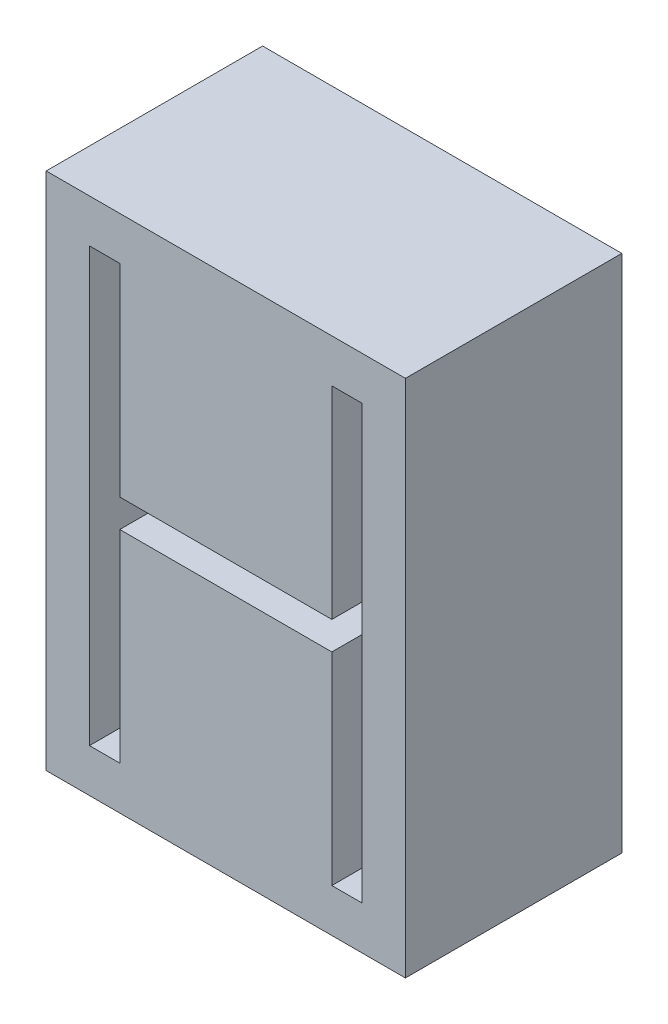
ISO-10303-21;
HEADER;
FILE_DESCRIPTION(('STEP AP214'),'2;1');
FILE_NAME('part.step','',(''),(''),'','','');
FILE_SCHEMA(('AUTOMOTIVE_DESIGN { 1 0 10303 214 1 1 1 1 }'));
ENDSEC;
DATA;
#1=APPLICATION_CONTEXT('core data for automotive mechanical design processes');
#2=APPLICATION_PROTOCOL_DEFINITION('international standard','automotive_design',2000,#1);
#3=PRODUCT_CONTEXT('',#1,'mechanical');
#4=PRODUCT('Part','Part','',(#3));
#5=PRODUCT_RELATED_PRODUCT_CATEGORY('part','',(#4));
#6=PRODUCT_DEFINITION_FORMATION('','',#4);
#7=PRODUCT_DEFINITION_CONTEXT('part definition',#1,'design');
#8=PRODUCT_DEFINITION('design','',#6,#7);
#9=PRODUCT_DEFINITION_SHAPE('','',#8);
#10=(LENGTH_UNIT() NAMED_UNIT(*) SI_UNIT(.MILLI.,.METRE.));
#11=(NAMED_UNIT(*) PLANE_ANGLE_UNIT() SI_UNIT($,.RADIAN.));
#12=(NAMED_UNIT(*) SI_UNIT($,.STERADIAN.) SOLID_ANGLE_UNIT());
#13=UNCERTAINTY_MEASURE_WITH_UNIT(LENGTH_MEASURE(1.E-05),#10,'distance_accuracy_value','');
#14=(GEOMETRIC_REPRESENTATION_CONTEXT(3) GLOBAL_UNCERTAINTY_ASSIGNED_CONTEXT((#13)) GLOBAL_UNIT_ASSIGNED_CONTEXT((#10,
#11,#12)) REPRESENTATION_CONTEXT('',''));
#15=CARTESIAN_POINT('',(0.,0.,0.));
#16=DIRECTION('',(0.,0.,1.));
#17=DIRECTION('',(1.,0.,0.));
#18=AXIS2_PLACEMENT_3D('',#15,#16,#17);
#19=CARTESIAN_POINT('',(0.,0.,10.));
#20=DIRECTION('',(0.,0.,-1.));
#21=DIRECTION('',(-1.,0.,0.));
#22=AXIS2_PLACEMENT_3D('',#19,#20,#21);
#23=PLANE('',#22);
#24=DIRECTION('',(0.,1.,0.));
#25=VECTOR('',#24,1.);
#26=CARTESIAN_POINT('',(8.3,-12.,10.));
#27=LINE('',#26,#25);
#28=CARTESIAN_POINT('',(8.3,-12.,10.));
#29=VERTEX_POINT('',#28);
#30=CARTESIAN_POINT('',(8.3,12.,10.));
#31=VERTEX_POINT('',#30);
#32=EDGE_CURVE('E255',#29,#31,#27,.T.);
#33=ORIENTED_EDGE('',*,*,#32,.T.);
#34=DIRECTION('',(-1.,0.,0.));
#35=VECTOR('',#34,1.);
#36=CARTESIAN_POINT('',(-8.3,12.,10.));
#37=LINE('',#36,#35);
#38=CARTESIAN_POINT('',(-8.3,12.,10.));
#39=VERTEX_POINT('',#38);
#40=EDGE_CURVE('E288',#31,#39,#37,.T.);
#41=ORIENTED_EDGE('',*,*,#40,.T.);
#42=DIRECTION('',(0.,-1.,0.));
#43=VECTOR('',#42,1.);
#44=CARTESIAN_POINT('',(-8.3,-12.,10.));
#45=LINE('',#44,#43);
#46=CARTESIAN_POINT('',(-8.3,-12.,10.));
#47=VERTEX_POINT('',#46);
#48=EDGE_CURVE('E241',#39,#47,#45,.T.);
#49=ORIENTED_EDGE('',*,*,#48,.T.);
#50=DIRECTION('',(1.,0.,0.));
#51=VECTOR('',#50,1.);
#52=CARTESIAN_POINT('',(-8.3,-12.,10.));
#53=LINE('',#52,#51);
#54=EDGE_CURVE('E236',#47,#29,#53,.T.);
#55=ORIENTED_EDGE('',*,*,#54,.T.);
#56=EDGE_LOOP('',(#33,#41,#49,#55));
#57=FACE_BOUND('',#56,.T.);
#58=DIRECTION('',(1.,0.,0.));
#59=VECTOR('',#58,1.);
#60=CARTESIAN_POINT('',(4.9,-10.,10.));
#61=LINE('',#60,#59);
#62=CARTESIAN_POINT('',(4.9,-10.,10.));
#63=VERTEX_POINT('',#62);
#64=CARTESIAN_POINT('',(6.3,-10.,10.));
#65=VERTEX_POINT('',#64);
#66=EDGE_CURVE('E154',#63,#65,#61,.T.);
#67=ORIENTED_EDGE('',*,*,#66,.F.);
#68=DIRECTION('',(0.,-1.,0.));
#69=VECTOR('',#68,1.);
#70=CARTESIAN_POINT('',(4.9,-10.,10.));
#71=LINE('',#70,#69);
#72=CARTESIAN_POINT('',(4.9,-0.65,10.));
#73=VERTEX_POINT('',#72);
#74=EDGE_CURVE('E226',#73,#63,#71,.T.);
#75=ORIENTED_EDGE('',*,*,#74,.F.);
#76=DIRECTION('',(1.,0.,0.));
#77=VECTOR('',#76,1.);
#78=CARTESIAN_POINT('',(-4.9,-0.65,10.));
#79=LINE('',#78,#77);
#80=CARTESIAN_POINT('',(-4.9,-0.65,10.));
#81=VERTEX_POINT('',#80);
#82=EDGE_CURVE('E222',#81,#73,#79,.T.);
#83=ORIENTED_EDGE('',*,*,#82,.F.);
#84=DIRECTION('',(0.,1.,0.));
#85=VECTOR('',#84,1.);
#86=CARTESIAN_POINT('',(-4.9,-10.,10.));
#87=LINE('',#86,#85);
#88=CARTESIAN_POINT('',(-4.9,-10.,10.));
#89=VERTEX_POINT('',#88);
#90=EDGE_CURVE('E218',#89,#81,#87,.T.);
#91=ORIENTED_EDGE('',*,*,#90,.F.);
#92=DIRECTION('',(1.,0.,0.));
#93=VECTOR('',#92,1.);
#94=CARTESIAN_POINT('',(-6.3,-10.,10.));
#95=LINE('',#94,#93);
#96=CARTESIAN_POINT('',(-6.3,-10.,10.));
#97=VERTEX_POINT('',#96);
#98=EDGE_CURVE('E215',#97,#89,#95,.T.);
#99=ORIENTED_EDGE('',*,*,#98,.F.);
#100=DIRECTION('',(0.,-1.,0.));
#101=VECTOR('',#100,1.);
#102=CARTESIAN_POINT('',(-6.3,10.,10.));
#103=LINE('',#102,#101);
#104=CARTESIAN_POINT('',(-6.3,10.,10.));
#105=VERTEX_POINT('',#104);
#106=EDGE_CURVE('E207',#105,#97,#103,.T.);
#107=ORIENTED_EDGE('',*,*,#106,.F.);
#108=DIRECTION('',(-1.,0.,0.));
#109=VECTOR('',#108,1.);
#110=CARTESIAN_POINT('',(-6.3,10.,10.));
#111=LINE('',#110,#109);
#112=CARTESIAN_POINT('',(-4.9,10.,10.));
#113=VERTEX_POINT('',#112);
#114=EDGE_CURVE('E203',#113,#105,#111,.T.);
#115=ORIENTED_EDGE('',*,*,#114,.F.);
#116=DIRECTION('',(0.,1.,0.));
#117=VECTOR('',#116,1.);
#118=CARTESIAN_POINT('',(-4.9,10.,10.));
#119=LINE('',#118,#117);
#120=CARTESIAN_POINT('',(-4.9,0.65,10.));
#121=VERTEX_POINT('',#120);
#122=EDGE_CURVE('E199',#121,#113,#119,.T.);
#123=ORIENTED_EDGE('',*,*,#122,.F.);
#124=DIRECTION('',(-1.,0.,0.));
#125=VECTOR('',#124,1.);
#126=CARTESIAN_POINT('',(-4.9,0.65,10.));
#127=LINE('',#126,#125);
#128=CARTESIAN_POINT('',(4.9,0.65,10.));
#129=VERTEX_POINT('',#128);
#130=EDGE_CURVE('E196',#129,#121,#127,.T.);
#131=ORIENTED_EDGE('',*,*,#130,.F.);
#132=DIRECTION('',(0.,-1.,0.));
#133=VECTOR('',#132,1.);
#134=CARTESIAN_POINT('',(4.9,10.,10.));
#135=LINE('',#134,#133);
#136=CARTESIAN_POINT('',(4.9,10.,10.));
#137=VERTEX_POINT('',#136);
#138=EDGE_CURVE('E183',#137,#129,#135,.T.);
#139=ORIENTED_EDGE('',*,*,#138,.F.);
#140=DIRECTION('',(-1.,0.,0.));
#141=VECTOR('',#140,1.);
#142=CARTESIAN_POINT('',(4.9,10.,10.));
#143=LINE('',#142,#141);
#144=CARTESIAN_POINT('',(6.3,10.,10.));
#145=VERTEX_POINT('',#144);
#146=EDGE_CURVE('E177',#145,#137,#143,.T.);
#147=ORIENTED_EDGE('',*,*,#146,.F.);
#148=DIRECTION('',(0.,1.,0.));
#149=VECTOR('',#148,1.);
#150=CARTESIAN_POINT('',(6.3,10.,10.));
#151=LINE('',#150,#149);
#152=EDGE_CURVE('E163',#65,#145,#151,.T.);
#153=ORIENTED_EDGE('',*,*,#152,.F.);
#154=EDGE_LOOP('',(#67,#75,#83,#91,#99,#107,#115,#123,#131,#139,#147,#153));
#155=FACE_BOUND('',#154,.T.);
#156=ADVANCED_FACE('F40',(#57,#155),#23,.F.);
#157=CARTESIAN_POINT('',(0.,0.,0.));
#158=DIRECTION('',(0.,0.,-1.));
#159=DIRECTION('',(-1.,0.,0.));
#160=AXIS2_PLACEMENT_3D('',#157,#158,#159);
#161=PLANE('',#160);
#162=DIRECTION('',(0.,1.,0.));
#163=VECTOR('',#162,1.);
#164=CARTESIAN_POINT('',(8.3,-12.,0.));
#165=LINE('',#164,#163);
#166=CARTESIAN_POINT('',(8.3,-12.,0.));
#167=VERTEX_POINT('',#166);
#168=CARTESIAN_POINT('',(8.3,12.,0.));
#169=VERTEX_POINT('',#168);
#170=EDGE_CURVE('E172',#167,#169,#165,.T.);
#171=ORIENTED_EDGE('',*,*,#170,.F.);
#172=DIRECTION('',(1.,0.,0.));
#173=VECTOR('',#172,1.);
#174=CARTESIAN_POINT('',(-8.3,-12.,0.));
#175=LINE('',#174,#173);
#176=CARTESIAN_POINT('',(-8.3,-12.,0.));
#177=VERTEX_POINT('',#176);
#178=EDGE_CURVE('E253',#177,#167,#175,.T.);
#179=ORIENTED_EDGE('',*,*,#178,.F.);
#180=DIRECTION('',(0.,-1.,0.));
#181=VECTOR('',#180,1.);
#182=CARTESIAN_POINT('',(-8.3,-12.,0.));
#183=LINE('',#182,#181);
#184=CARTESIAN_POINT('',(-8.3,12.,0.));
#185=VERTEX_POINT('',#184);
#186=EDGE_CURVE('E250',#185,#177,#183,.T.);
#187=ORIENTED_EDGE('',*,*,#186,.F.);
#188=DIRECTION('',(-1.,0.,0.));
#189=VECTOR('',#188,1.);
#190=CARTESIAN_POINT('',(-8.3,12.,0.));
#191=LINE('',#190,#189);
#192=EDGE_CURVE('E247',#169,#185,#191,.T.);
#193=ORIENTED_EDGE('',*,*,#192,.F.);
#194=EDGE_LOOP('',(#171,#179,#187,#193));
#195=FACE_BOUND('',#194,.T.);
#196=DIRECTION('',(0.,-1.,0.));
#197=VECTOR('',#196,1.);
#198=CARTESIAN_POINT('',(4.9,-10.,0.));
#199=LINE('',#198,#197);
#200=CARTESIAN_POINT('',(4.9,-0.65,0.));
#201=VERTEX_POINT('',#200);
#202=CARTESIAN_POINT('',(4.9,-10.,0.));
#203=VERTEX_POINT('',#202);
#204=EDGE_CURVE('E164',#201,#203,#199,.T.);
#205=ORIENTED_EDGE('',*,*,#204,.T.);
#206=DIRECTION('',(1.,0.,0.));
#207=VECTOR('',#206,1.);
#208=CARTESIAN_POINT('',(4.9,-10.,0.));
#209=LINE('',#208,#207);
#210=CARTESIAN_POINT('',(6.3,-10.,0.));
#211=VERTEX_POINT('',#210);
#212=EDGE_CURVE('E64',#203,#211,#209,.T.);
#213=ORIENTED_EDGE('',*,*,#212,.T.);
#214=DIRECTION('',(0.,1.,0.));
#215=VECTOR('',#214,1.);
#216=CARTESIAN_POINT('',(6.3,10.,0.));
#217=LINE('',#216,#215);
#218=CARTESIAN_POINT('',(6.3,10.,0.));
#219=VERTEX_POINT('',#218);
#220=EDGE_CURVE('E170',#211,#219,#217,.T.);
#221=ORIENTED_EDGE('',*,*,#220,.T.);
#222=DIRECTION('',(-1.,0.,0.));
#223=VECTOR('',#222,1.);
#224=CARTESIAN_POINT('',(4.9,10.,0.));
#225=LINE('',#224,#223);
#226=CARTESIAN_POINT('',(4.9,10.,0.));
#227=VERTEX_POINT('',#226);
#228=EDGE_CURVE('E359',#219,#227,#225,.T.);
#229=ORIENTED_EDGE('',*,*,#228,.T.);
#230=DIRECTION('',(0.,-1.,0.));
#231=VECTOR('',#230,1.);
#232=CARTESIAN_POINT('',(4.9,10.,0.));
#233=LINE('',#232,#231);
#234=CARTESIAN_POINT('',(4.9,0.65,0.));
#235=VERTEX_POINT('',#234);
#236=EDGE_CURVE('E355',#227,#235,#233,.T.);
#237=ORIENTED_EDGE('',*,*,#236,.T.);
#238=DIRECTION('',(-1.,0.,0.));
#239=VECTOR('',#238,1.);
#240=CARTESIAN_POINT('',(-4.9,0.65,0.));
#241=LINE('',#240,#239);
#242=CARTESIAN_POINT('',(-4.9,0.65,0.));
#243=VERTEX_POINT('',#242);
#244=EDGE_CURVE('E352',#235,#243,#241,.T.);
#245=ORIENTED_EDGE('',*,*,#244,.T.);
#246=DIRECTION('',(0.,1.,0.));
#247=VECTOR('',#246,1.);
#248=CARTESIAN_POINT('',(-4.9,10.,0.));
#249=LINE('',#248,#247);
#250=CARTESIAN_POINT('',(-4.9,10.,0.));
#251=VERTEX_POINT('',#250);
#252=EDGE_CURVE('E348',#243,#251,#249,.T.);
#253=ORIENTED_EDGE('',*,*,#252,.T.);
#254=DIRECTION('',(-1.,0.,0.));
#255=VECTOR('',#254,1.);
#256=CARTESIAN_POINT('',(-6.3,10.,0.));
#257=LINE('',#256,#255);
#258=CARTESIAN_POINT('',(-6.3,10.,0.));
#259=VERTEX_POINT('',#258);
#260=EDGE_CURVE('E344',#251,#259,#257,.T.);
#261=ORIENTED_EDGE('',*,*,#260,.T.);
#262=DIRECTION('',(0.,-1.,0.));
#263=VECTOR('',#262,1.);
#264=CARTESIAN_POINT('',(-6.3,10.,0.));
#265=LINE('',#264,#263);
#266=CARTESIAN_POINT('',(-6.3,-10.,0.));
#267=VERTEX_POINT('',#266);
#268=EDGE_CURVE('E340',#259,#267,#265,.T.);
#269=ORIENTED_EDGE('',*,*,#268,.T.);
#270=DIRECTION('',(1.,0.,0.));
#271=VECTOR('',#270,1.);
#272=CARTESIAN_POINT('',(-6.3,-10.,0.));
#273=LINE('',#272,#271);
#274=CARTESIAN_POINT('',(-4.9,-10.,0.));
#275=VERTEX_POINT('',#274);
#276=EDGE_CURVE('E336',#267,#275,#273,.T.);
#277=ORIENTED_EDGE('',*,*,#276,.T.);
#278=DIRECTION('',(0.,1.,0.));
#279=VECTOR('',#278,1.);
#280=CARTESIAN_POINT('',(-4.9,-10.,0.));
#281=LINE('',#280,#279);
#282=CARTESIAN_POINT('',(-4.9,-0.65,0.));
#283=VERTEX_POINT('',#282);
#284=EDGE_CURVE('E332',#275,#283,#281,.T.);
#285=ORIENTED_EDGE('',*,*,#284,.T.);
#286=DIRECTION('',(1.,0.,0.));
#287=VECTOR('',#286,1.);
#288=CARTESIAN_POINT('',(-4.9,-0.65,0.));
#289=LINE('',#288,#287);
#290=EDGE_CURVE('E329',#283,#201,#289,.T.);
#291=ORIENTED_EDGE('',*,*,#290,.T.);
#292=EDGE_LOOP('',(#205,#213,#221,#229,#237,#245,#253,#261,#269,#277,#285,#291));
#293=FACE_BOUND('',#292,.T.);
#294=ADVANCED_FACE('F276',(#195,#293),#161,.T.);
#295=CARTESIAN_POINT('',(8.3,-12.,10.));
#296=DIRECTION('',(-1.,0.,0.));
#297=DIRECTION('',(0.,0.,1.));
#298=AXIS2_PLACEMENT_3D('',#295,#296,#297);
#299=PLANE('',#298);
#300=ORIENTED_EDGE('',*,*,#170,.T.);
#301=DIRECTION('',(0.,0.,-1.));
#302=VECTOR('',#301,1.);
#303=CARTESIAN_POINT('',(8.3,12.,10.));
#304=LINE('',#303,#302);
#305=EDGE_CURVE('E12',#31,#169,#304,.T.);
#306=ORIENTED_EDGE('',*,*,#305,.F.);
#307=ORIENTED_EDGE('',*,*,#32,.F.);
#308=DIRECTION('',(0.,0.,-1.));
#309=VECTOR('',#308,1.);
#310=CARTESIAN_POINT('',(8.3,-12.,10.));
#311=LINE('',#310,#309);
#312=EDGE_CURVE('E240',#29,#167,#311,.T.);
#313=ORIENTED_EDGE('',*,*,#312,.T.);
#314=EDGE_LOOP('',(#300,#306,#307,#313));
#315=FACE_BOUND('',#314,.T.);
#316=ADVANCED_FACE('F42',(#315),#299,.F.);
#317=CARTESIAN_POINT('',(-8.3,12.,10.));
#318=DIRECTION('',(0.,-1.,0.));
#319=DIRECTION('',(0.,0.,-1.));
#320=AXIS2_PLACEMENT_3D('',#317,#318,#319);
#321=PLANE('',#320);
#322=ORIENTED_EDGE('',*,*,#192,.T.);
#323=DIRECTION('',(0.,0.,-1.));
#324=VECTOR('',#323,1.);
#325=CARTESIAN_POINT('',(-8.3,12.,10.));
#326=LINE('',#325,#324);
#327=EDGE_CURVE('E49',#39,#185,#326,.T.);
#328=ORIENTED_EDGE('',*,*,#327,.F.);
#329=ORIENTED_EDGE('',*,*,#40,.F.);
#330=ORIENTED_EDGE('',*,*,#305,.T.);
#331=EDGE_LOOP('',(#322,#328,#329,#330));
#332=FACE_BOUND('',#331,.T.);
#333=ADVANCED_FACE('F444',(#332),#321,.F.);
#334=CARTESIAN_POINT('',(-8.3,-12.,10.));
#335=DIRECTION('',(1.,0.,0.));
#336=DIRECTION('',(0.,0.,-1.));
#337=AXIS2_PLACEMENT_3D('',#334,#335,#336);
#338=PLANE('',#337);
#339=ORIENTED_EDGE('',*,*,#186,.T.);
#340=DIRECTION('',(0.,0.,-1.));
#341=VECTOR('',#340,1.);
#342=CARTESIAN_POINT('',(-8.3,-12.,10.));
#343=LINE('',#342,#341);
#344=EDGE_CURVE('E259',#47,#177,#343,.T.);
#345=ORIENTED_EDGE('',*,*,#344,.F.);
#346=ORIENTED_EDGE('',*,*,#48,.F.);
#347=ORIENTED_EDGE('',*,*,#327,.T.);
#348=EDGE_LOOP('',(#339,#345,#346,#347));
#349=FACE_BOUND('',#348,.T.);
#350=ADVANCED_FACE('F270',(#349),#338,.F.);
#351=CARTESIAN_POINT('',(-8.3,-12.,10.));
#352=DIRECTION('',(0.,1.,0.));
#353=DIRECTION('',(0.,0.,1.));
#354=AXIS2_PLACEMENT_3D('',#351,#352,#353);
#355=PLANE('',#354);
#356=ORIENTED_EDGE('',*,*,#178,.T.);
#357=ORIENTED_EDGE('',*,*,#312,.F.);
#358=ORIENTED_EDGE('',*,*,#54,.F.);
#359=ORIENTED_EDGE('',*,*,#344,.T.);
#360=EDGE_LOOP('',(#356,#357,#358,#359));
#361=FACE_BOUND('',#360,.T.);
#362=ADVANCED_FACE('F280',(#361),#355,.F.);
#363=CARTESIAN_POINT('',(4.9,-10.,10.));
#364=DIRECTION('',(0.,1.,0.));
#365=DIRECTION('',(-1.,0.,0.));
#366=AXIS2_PLACEMENT_3D('',#363,#364,#365);
#367=PLANE('',#366);
#368=ORIENTED_EDGE('',*,*,#212,.F.);
#369=DIRECTION('',(0.,0.,-1.));
#370=VECTOR('',#369,1.);
#371=CARTESIAN_POINT('',(4.9,-10.,10.));
#372=LINE('',#371,#370);
#373=EDGE_CURVE('E158',#63,#203,#372,.T.);
#374=ORIENTED_EDGE('',*,*,#373,.F.);
#375=ORIENTED_EDGE('',*,*,#66,.T.);
#376=DIRECTION('',(0.,0.,-1.));
#377=VECTOR('',#376,1.);
#378=CARTESIAN_POINT('',(6.3,-10.,10.));
#379=LINE('',#378,#377);
#380=EDGE_CURVE('E157',#65,#211,#379,.T.);
#381=ORIENTED_EDGE('',*,*,#380,.T.);
#382=EDGE_LOOP('',(#368,#374,#375,#381));
#383=FACE_BOUND('',#382,.T.);
#384=ADVANCED_FACE('F156',(#383),#367,.T.);
#385=CARTESIAN_POINT('',(6.3,10.,10.));
#386=DIRECTION('',(-1.,0.,0.));
#387=DIRECTION('',(0.,0.,1.));
#388=AXIS2_PLACEMENT_3D('',#385,#386,#387);
#389=PLANE('',#388);
#390=ORIENTED_EDGE('',*,*,#220,.F.);
#391=ORIENTED_EDGE('',*,*,#380,.F.);
#392=ORIENTED_EDGE('',*,*,#152,.T.);
#393=DIRECTION('',(0.,0.,-1.));
#394=VECTOR('',#393,1.);
#395=CARTESIAN_POINT('',(6.3,10.,10.));
#396=LINE('',#395,#394);
#397=EDGE_CURVE('E173',#145,#219,#396,.T.);
#398=ORIENTED_EDGE('',*,*,#397,.T.);
#399=EDGE_LOOP('',(#390,#391,#392,#398));
#400=FACE_BOUND('',#399,.T.);
#401=ADVANCED_FACE('F167',(#400),#389,.T.);
#402=CARTESIAN_POINT('',(4.9,10.,10.));
#403=DIRECTION('',(0.,-1.,0.));
#404=DIRECTION('',(1.,0.,0.));
#405=AXIS2_PLACEMENT_3D('',#402,#403,#404);
#406=PLANE('',#405);
#407=ORIENTED_EDGE('',*,*,#228,.F.);
#408=ORIENTED_EDGE('',*,*,#397,.F.);
#409=ORIENTED_EDGE('',*,*,#146,.T.);
#410=DIRECTION('',(0.,0.,-1.));
#411=VECTOR('',#410,1.);
#412=CARTESIAN_POINT('',(4.9,10.,10.));
#413=LINE('',#412,#411);
#414=EDGE_CURVE('E299',#137,#227,#413,.T.);
#415=ORIENTED_EDGE('',*,*,#414,.T.);
#416=EDGE_LOOP('',(#407,#408,#409,#415));
#417=FACE_BOUND('',#416,.T.);
#418=ADVANCED_FACE('F424',(#417),#406,.T.);
#419=CARTESIAN_POINT('',(4.9,10.,10.));
#420=DIRECTION('',(1.,0.,0.));
#421=DIRECTION('',(0.,0.,-1.));
#422=AXIS2_PLACEMENT_3D('',#419,#420,#421);
#423=PLANE('',#422);
#424=ORIENTED_EDGE('',*,*,#236,.F.);
#425=ORIENTED_EDGE('',*,*,#414,.F.);
#426=ORIENTED_EDGE('',*,*,#138,.T.);
#427=DIRECTION('',(0.,0.,-1.));
#428=VECTOR('',#427,1.);
#429=CARTESIAN_POINT('',(4.9,0.65,10.));
#430=LINE('',#429,#428);
#431=EDGE_CURVE('E302',#129,#235,#430,.T.);
#432=ORIENTED_EDGE('',*,*,#431,.T.);
#433=EDGE_LOOP('',(#424,#425,#426,#432));
#434=FACE_BOUND('',#433,.T.);
#435=ADVANCED_FACE('F420',(#434),#423,.T.);
#436=CARTESIAN_POINT('',(-4.9,0.65,10.));
#437=DIRECTION('',(0.,-1.,0.));
#438=DIRECTION('',(0.,0.,-1.));
#439=AXIS2_PLACEMENT_3D('',#436,#437,#438);
#440=PLANE('',#439);
#441=ORIENTED_EDGE('',*,*,#244,.F.);
#442=ORIENTED_EDGE('',*,*,#431,.F.);
#443=ORIENTED_EDGE('',*,*,#130,.T.);
#444=DIRECTION('',(0.,0.,-1.));
#445=VECTOR('',#444,1.);
#446=CARTESIAN_POINT('',(-4.9,0.65,10.));
#447=LINE('',#446,#445);
#448=EDGE_CURVE('E305',#121,#243,#447,.T.);
#449=ORIENTED_EDGE('',*,*,#448,.T.);
#450=EDGE_LOOP('',(#441,#442,#443,#449));
#451=FACE_BOUND('',#450,.T.);
#452=ADVANCED_FACE('F416',(#451),#440,.T.);
#453=CARTESIAN_POINT('',(-4.9,10.,10.));
#454=DIRECTION('',(-1.,0.,0.));
#455=DIRECTION('',(0.,0.,1.));
#456=AXIS2_PLACEMENT_3D('',#453,#454,#455);
#457=PLANE('',#456);
#458=ORIENTED_EDGE('',*,*,#252,.F.);
#459=ORIENTED_EDGE('',*,*,#448,.F.);
#460=ORIENTED_EDGE('',*,*,#122,.T.);
#461=DIRECTION('',(0.,0.,-1.));
#462=VECTOR('',#461,1.);
#463=CARTESIAN_POINT('',(-4.9,10.,10.));
#464=LINE('',#463,#462);
#465=EDGE_CURVE('E308',#113,#251,#464,.T.);
#466=ORIENTED_EDGE('',*,*,#465,.T.);
#467=EDGE_LOOP('',(#458,#459,#460,#466));
#468=FACE_BOUND('',#467,.T.);
#469=ADVANCED_FACE('F413',(#468),#457,.T.);
#470=CARTESIAN_POINT('',(-6.3,10.,10.));
#471=DIRECTION('',(0.,-1.,0.));
#472=DIRECTION('',(1.,0.,0.));
#473=AXIS2_PLACEMENT_3D('',#470,#471,#472);
#474=PLANE('',#473);
#475=ORIENTED_EDGE('',*,*,#260,.F.);
#476=ORIENTED_EDGE('',*,*,#465,.F.);
#477=ORIENTED_EDGE('',*,*,#114,.T.);
#478=DIRECTION('',(0.,0.,-1.));
#479=VECTOR('',#478,1.);
#480=CARTESIAN_POINT('',(-6.3,10.,10.));
#481=LINE('',#480,#479);
#482=EDGE_CURVE('E311',#105,#259,#481,.T.);
#483=ORIENTED_EDGE('',*,*,#482,.T.);
#484=EDGE_LOOP('',(#475,#476,#477,#483));
#485=FACE_BOUND('',#484,.T.);
#486=ADVANCED_FACE('F408',(#485),#474,.T.);
#487=CARTESIAN_POINT('',(-6.3,10.,10.));
#488=DIRECTION('',(1.,0.,0.));
#489=DIRECTION('',(0.,0.,-1.));
#490=AXIS2_PLACEMENT_3D('',#487,#488,#489);
#491=PLANE('',#490);
#492=ORIENTED_EDGE('',*,*,#268,.F.);
#493=ORIENTED_EDGE('',*,*,#482,.F.);
#494=ORIENTED_EDGE('',*,*,#106,.T.);
#495=DIRECTION('',(0.,0.,-1.));
#496=VECTOR('',#495,1.);
#497=CARTESIAN_POINT('',(-6.3,-10.,10.));
#498=LINE('',#497,#496);
#499=EDGE_CURVE('E314',#97,#267,#498,.T.);
#500=ORIENTED_EDGE('',*,*,#499,.T.);
#501=EDGE_LOOP('',(#492,#493,#494,#500));
#502=FACE_BOUND('',#501,.T.);
#503=ADVANCED_FACE('F390',(#502),#491,.T.);
#504=CARTESIAN_POINT('',(-6.3,-10.,10.));
#505=DIRECTION('',(0.,1.,0.));
#506=DIRECTION('',(-1.,0.,0.));
#507=AXIS2_PLACEMENT_3D('',#504,#505,#506);
#508=PLANE('',#507);
#509=ORIENTED_EDGE('',*,*,#276,.F.);
#510=ORIENTED_EDGE('',*,*,#499,.F.);
#511=ORIENTED_EDGE('',*,*,#98,.T.);
#512=DIRECTION('',(0.,0.,-1.));
#513=VECTOR('',#512,1.);
#514=CARTESIAN_POINT('',(-4.9,-10.,10.));
#515=LINE('',#514,#513);
#516=EDGE_CURVE('E317',#89,#275,#515,.T.);
#517=ORIENTED_EDGE('',*,*,#516,.T.);
#518=EDGE_LOOP('',(#509,#510,#511,#517));
#519=FACE_BOUND('',#518,.T.);
#520=ADVANCED_FACE('F395',(#519),#508,.T.);
#521=CARTESIAN_POINT('',(-4.9,-10.,10.));
#522=DIRECTION('',(-1.,0.,0.));
#523=DIRECTION('',(0.,0.,1.));
#524=AXIS2_PLACEMENT_3D('',#521,#522,#523);
#525=PLANE('',#524);
#526=ORIENTED_EDGE('',*,*,#284,.F.);
#527=ORIENTED_EDGE('',*,*,#516,.F.);
#528=ORIENTED_EDGE('',*,*,#90,.T.);
#529=DIRECTION('',(0.,0.,-1.));
#530=VECTOR('',#529,1.);
#531=CARTESIAN_POINT('',(-4.9,-0.65,10.));
#532=LINE('',#531,#530);
#533=EDGE_CURVE('E320',#81,#283,#532,.T.);
#534=ORIENTED_EDGE('',*,*,#533,.T.);
#535=EDGE_LOOP('',(#526,#527,#528,#534));
#536=FACE_BOUND('',#535,.T.);
#537=ADVANCED_FACE('F401',(#536),#525,.T.);
#538=CARTESIAN_POINT('',(-4.9,-0.65,10.));
#539=DIRECTION('',(0.,1.,0.));
#540=DIRECTION('',(0.,0.,1.));
#541=AXIS2_PLACEMENT_3D('',#538,#539,#540);
#542=PLANE('',#541);
#543=ORIENTED_EDGE('',*,*,#290,.F.);
#544=ORIENTED_EDGE('',*,*,#533,.F.);
#545=ORIENTED_EDGE('',*,*,#82,.T.);
#546=DIRECTION('',(0.,0.,-1.));
#547=VECTOR('',#546,1.);
#548=CARTESIAN_POINT('',(4.9,-0.65,10.));
#549=LINE('',#548,#547);
#550=EDGE_CURVE('E56',#73,#201,#549,.T.);
#551=ORIENTED_EDGE('',*,*,#550,.T.);
#552=EDGE_LOOP('',(#543,#544,#545,#551));
#553=FACE_BOUND('',#552,.T.);
#554=ADVANCED_FACE('F403',(#553),#542,.T.);
#555=CARTESIAN_POINT('',(4.9,-10.,10.));
#556=DIRECTION('',(1.,0.,0.));
#557=DIRECTION('',(0.,0.,-1.));
#558=AXIS2_PLACEMENT_3D('',#555,#556,#557);
#559=PLANE('',#558);
#560=ORIENTED_EDGE('',*,*,#204,.F.);
#561=ORIENTED_EDGE('',*,*,#550,.F.);
#562=ORIENTED_EDGE('',*,*,#74,.T.);
#563=ORIENTED_EDGE('',*,*,#373,.T.);
#564=EDGE_LOOP('',(#560,#561,#562,#563));
#565=FACE_BOUND('',#564,.T.);
#566=ADVANCED_FACE('F366',(#565),#559,.T.);
#567=CLOSED_SHELL('',(#156,#294,#316,#333,#350,#362,#384,#401,#418,#435,#452,#469,#486,#503,
#520,#537,#554,#566));
#568=MANIFOLD_SOLID_BREP('B2',#567);
#569=ADVANCED_BREP_SHAPE_REPRESENTATION('',(#18,#568),#14);
#570=SHAPE_DEFINITION_REPRESENTATION(#9,#569);
ENDSEC;
END-ISO-10303-21;
